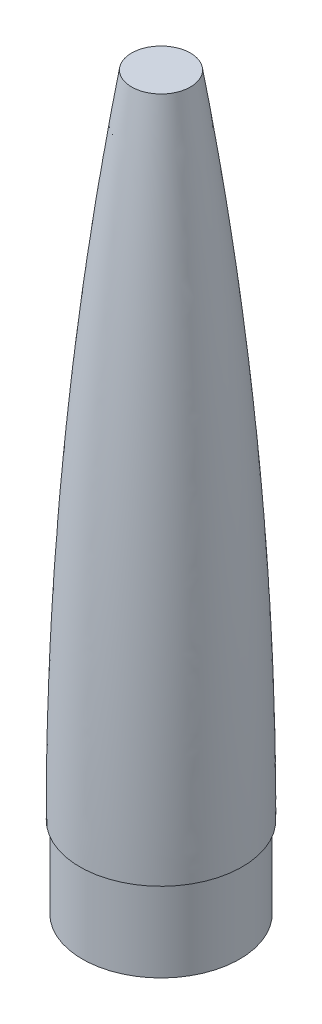
ISO-10303-21;
HEADER;
FILE_DESCRIPTION(('STEP AP214'),'2;1');
FILE_NAME('part.step','',(''),(''),'','','');
FILE_SCHEMA(('AUTOMOTIVE_DESIGN { 1 0 10303 214 1 1 1 1 }'));
ENDSEC;
DATA;
#1=APPLICATION_CONTEXT('core data for automotive mechanical design processes');
#2=APPLICATION_PROTOCOL_DEFINITION('international standard','automotive_design',2000,#1);
#3=PRODUCT_CONTEXT('',#1,'mechanical');
#4=PRODUCT('Part','Part','',(#3));
#5=PRODUCT_RELATED_PRODUCT_CATEGORY('part','',(#4));
#6=PRODUCT_DEFINITION_FORMATION('','',#4);
#7=PRODUCT_DEFINITION_CONTEXT('part definition',#1,'design');
#8=PRODUCT_DEFINITION('design','',#6,#7);
#9=PRODUCT_DEFINITION_SHAPE('','',#8);
#10=(LENGTH_UNIT() NAMED_UNIT(*) SI_UNIT(.MILLI.,.METRE.));
#11=(NAMED_UNIT(*) PLANE_ANGLE_UNIT() SI_UNIT($,.RADIAN.));
#12=(NAMED_UNIT(*) SI_UNIT($,.STERADIAN.) SOLID_ANGLE_UNIT());
#13=UNCERTAINTY_MEASURE_WITH_UNIT(LENGTH_MEASURE(1.E-05),#10,'distance_accuracy_value','');
#14=(GEOMETRIC_REPRESENTATION_CONTEXT(3) GLOBAL_UNCERTAINTY_ASSIGNED_CONTEXT((#13)) GLOBAL_UNIT_ASSIGNED_CONTEXT((#10,
#11,#12)) REPRESENTATION_CONTEXT('',''));
#15=CARTESIAN_POINT('',(0.,0.,0.));
#16=DIRECTION('',(0.,0.,1.));
#17=DIRECTION('',(1.,0.,0.));
#18=AXIS2_PLACEMENT_3D('',#15,#16,#17);
#19=CARTESIAN_POINT('',(1.71600060805526E-11,812.8,0.));
#20=DIRECTION('',(0.,-1.,0.));
#21=DIRECTION('',(0.,0.,-1.));
#22=AXIS2_PLACEMENT_3D('',#19,#20,#21);
#23=PLANE('',#22);
#24=CARTESIAN_POINT('',(0.,812.800000000001,0.));
#25=DIRECTION('',(0.,-1.,0.));
#26=DIRECTION('',(0.,0.,-1.));
#27=AXIS2_PLACEMENT_3D('',#24,#25,#26);
#28=CIRCLE('',#27,36.8107382436538);
#29=CARTESIAN_POINT('',(0.,812.800000000001,-36.8107382436538));
#30=VERTEX_POINT('',#29);
#31=EDGE_CURVE('E10',#30,#30,#28,.T.);
#32=ORIENTED_EDGE('',*,*,#31,.F.);
#33=EDGE_LOOP('',(#32));
#34=FACE_BOUND('',#33,.T.);
#35=ADVANCED_FACE('F34',(#34),#23,.F.);
#36=CARTESIAN_POINT('',(-36.8107382436399,812.800000000088,0.));
#37=CARTESIAN_POINT('',(-36.9942778675381,811.656036287534,0.));
#38=CARTESIAN_POINT('',(-37.3628701438847,809.352341120219,0.));
#39=CARTESIAN_POINT('',(-38.4059770860057,802.812851723432,0.));
#40=CARTESIAN_POINT('',(-39.4063445534059,796.466868939399,0.));
#41=CARTESIAN_POINT('',(-40.5094000899044,789.417479858415,0.));
#42=CARTESIAN_POINT('',(-41.5636705533657,782.608785029749,0.));
#43=CARTESIAN_POINT('',(-42.4113425012624,777.097281594064,0.));
#44=CARTESIAN_POINT('',(-43.2542378182177,771.576058872733,0.));
#45=CARTESIAN_POINT('',(-44.0966419124056,766.017705101634,0.));
#46=CARTESIAN_POINT('',(-44.9372574635269,760.429599919701,0.));
#47=CARTESIAN_POINT('',(-45.7762764460643,754.809835943887,0.));
#48=CARTESIAN_POINT('',(-46.8172442930843,747.784136419474,0.));
#49=CARTESIAN_POINT('',(-48.0539669097659,739.351391314448,0.));
#50=CARTESIAN_POINT('',(-49.4786435972294,729.510576954662,0.));
#51=CARTESIAN_POINT('',(-51.8835815258252,712.635208419306,0.));
#52=CARTESIAN_POINT('',(-56.1784053374686,681.680921395609,0.));
#53=CARTESIAN_POINT('',(-64.3108872319733,619.70971154683,0.));
#54=CARTESIAN_POINT('',(-79.9569813158618,484.234101922189,0.));
#55=CARTESIAN_POINT('',(-91.5619165522518,342.613670709071,0.));
#56=CARTESIAN_POINT('',(-98.2796599898014,206.379377523321,0.));
#57=CARTESIAN_POINT('',(-100.665151632326,101.288631045201,0.));
#58=CARTESIAN_POINT('',(-101.121916521398,71.4617361512993,0.));
#59=CARTESIAN_POINT('',(-101.305723043407,55.1271513591144,0.));
#60=CARTESIAN_POINT('',(-101.362315117216,49.445475511436,0.));
#61=CARTESIAN_POINT('',(-101.40133044313,45.2148835602699,0.));
#62=CARTESIAN_POINT('',(-101.436995751518,41.014909000731,0.));
#63=CARTESIAN_POINT('',(-101.474006364349,36.1352064160095,0.));
#64=CARTESIAN_POINT('',(-101.510147859518,30.5749997133623,0.));
#65=CARTESIAN_POINT('',(-101.540265836947,25.0243241942418,0.));
#66=CARTESIAN_POINT('',(-101.564360261357,19.4325637363225,0.));
#67=CARTESIAN_POINT('',(-101.582431104395,13.9273200626215,0.));
#68=CARTESIAN_POINT('',(-101.594478344888,8.48550626468115,0.));
#69=CARTESIAN_POINT('',(-101.598996062713,3.49324912068522,0.));
#70=CARTESIAN_POINT('',(-101.600000000008,1.15859381780288,0.));
#71=CARTESIAN_POINT('',(-101.600000000008,3.29251402703047E-12,0.));
#72=B_SPLINE_CURVE_WITH_KNOTS('',4,(#36,#37,#38,#39,#40,#41,#42,#43,#44,#45,#46,#47,#48,#49,#50,
#51,#52,#53,#54,#55,#56,#57,#58,#59,#60,#61,#62,#63,#64,#65,#66,#67,#68,#69,#70,#71),
.UNSPECIFIED.,.F.,.F.,(5,1,1,1,1,1,1,1,1,1,1,1,1,1,1,1,1,1,1,1,1,1,1,1,1,1,1,1,1,1,1,1,5),
(0.0833623092059593,0.0890400308531439,0.0947177525003284,0.106073195794698,0.111750917441882,
0.117428639089067,0.123106360736251,0.128784082383436,0.134587047619085,0.140390012854735,
0.146192978090384,0.151995943326034,0.163601873797332,0.175207804268631,0.186813734709129,
0.22163152603062,0.291267108032858,0.430538273603116,0.743898395082925,0.801928047381381,
0.84835176909009,0.859957699551707,0.865760664782516,0.86866214739792,0.871563630013324,
0.87724135137609,0.882919072738856,0.888596794101622,0.894274515464387,0.899952236827153,
0.905629958189919,0.911307679552684,0.91698540091545),.UNSPECIFIED.);
#73=CARTESIAN_POINT('',(0.,0.,0.));
#74=DIRECTION('',(0.,-1.,0.));
#75=AXIS1_PLACEMENT('',#73,#74);
#76=SURFACE_OF_REVOLUTION('',#72,#75);
#77=CARTESIAN_POINT('',(0.,1.33226762955019E-12,0.));
#78=DIRECTION('',(0.,-1.,0.));
#79=DIRECTION('',(0.,0.,-1.));
#80=AXIS2_PLACEMENT_3D('',#77,#78,#79);
#81=CIRCLE('',#80,101.600000000008);
#82=CARTESIAN_POINT('',(0.,1.33226762955019E-12,-101.600000000008));
#83=VERTEX_POINT('',#82);
#84=EDGE_CURVE('E40',#83,#83,#81,.T.);
#85=ORIENTED_EDGE('',*,*,#84,.F.);
#86=EDGE_LOOP('',(#85));
#87=FACE_BOUND('',#86,.T.);
#88=ORIENTED_EDGE('',*,*,#31,.T.);
#89=EDGE_LOOP('',(#88));
#90=FACE_BOUND('',#89,.T.);
#91=ADVANCED_FACE('F64',(#87,#90),#76,.T.);
#92=CARTESIAN_POINT('',(0.,6.66133814775094E-13,0.));
#93=DIRECTION('',(0.,-1.,0.));
#94=DIRECTION('',(0.,0.,-1.));
#95=AXIS2_PLACEMENT_3D('',#92,#93,#94);
#96=PLANE('',#95);
#97=ORIENTED_EDGE('',*,*,#84,.T.);
#98=EDGE_LOOP('',(#97));
#99=FACE_BOUND('',#98,.T.);
#100=CARTESIAN_POINT('',(0.,0.,0.));
#101=DIRECTION('',(0.,-1.,0.));
#102=DIRECTION('',(0.,0.,-1.));
#103=AXIS2_PLACEMENT_3D('',#100,#101,#102);
#104=CIRCLE('',#103,98.4250000000084);
#105=CARTESIAN_POINT('',(0.,0.,-98.4250000000084));
#106=VERTEX_POINT('',#105);
#107=EDGE_CURVE('E44',#106,#106,#104,.T.);
#108=ORIENTED_EDGE('',*,*,#107,.F.);
#109=EDGE_LOOP('',(#108));
#110=FACE_BOUND('',#109,.T.);
#111=ADVANCED_FACE('F69',(#99,#110),#96,.T.);
#112=CARTESIAN_POINT('',(0.,0.,0.));
#113=DIRECTION('',(0.,-1.,0.));
#114=DIRECTION('',(0.,0.,-1.));
#115=AXIS2_PLACEMENT_3D('',#112,#113,#114);
#116=CYLINDRICAL_SURFACE('',#115,98.4250000000083);
#117=CARTESIAN_POINT('',(0.,-101.6,0.));
#118=DIRECTION('',(0.,-1.,0.));
#119=DIRECTION('',(0.,0.,-1.));
#120=AXIS2_PLACEMENT_3D('',#117,#118,#119);
#121=CIRCLE('',#120,98.4250000000083);
#122=CARTESIAN_POINT('',(0.,-101.6,-98.4250000000083));
#123=VERTEX_POINT('',#122);
#124=EDGE_CURVE('E48',#123,#123,#121,.T.);
#125=ORIENTED_EDGE('',*,*,#124,.F.);
#126=EDGE_LOOP('',(#125));
#127=FACE_BOUND('',#126,.T.);
#128=ORIENTED_EDGE('',*,*,#107,.T.);
#129=EDGE_LOOP('',(#128));
#130=FACE_BOUND('',#129,.T.);
#131=ADVANCED_FACE('F85',(#127,#130),#116,.T.);
#132=CARTESIAN_POINT('',(0.,-101.6,0.));
#133=DIRECTION('',(0.,1.,0.));
#134=DIRECTION('',(0.,0.,1.));
#135=AXIS2_PLACEMENT_3D('',#132,#133,#134);
#136=PLANE('',#135);
#137=CARTESIAN_POINT('',(0.,-101.6,0.));
#138=DIRECTION('',(0.,1.,0.));
#139=DIRECTION('',(0.,0.,1.));
#140=AXIS2_PLACEMENT_3D('',#137,#138,#139);
#141=CIRCLE('',#140,95.2500000000083);
#142=CARTESIAN_POINT('',(0.,-101.6,95.2500000000083));
#143=VERTEX_POINT('',#142);
#144=EDGE_CURVE('E58',#143,#143,#141,.F.);
#145=ORIENTED_EDGE('',*,*,#144,.F.);
#146=EDGE_LOOP('',(#145));
#147=FACE_BOUND('',#146,.T.);
#148=ORIENTED_EDGE('',*,*,#124,.T.);
#149=EDGE_LOOP('',(#148));
#150=FACE_BOUND('',#149,.T.);
#151=ADVANCED_FACE('F81',(#147,#150),#136,.F.);
#152=CARTESIAN_POINT('',(1.71600060805526E-11,809.625,0.));
#153=DIRECTION('',(0.,-1.,0.));
#154=DIRECTION('',(0.,0.,-1.));
#155=AXIS2_PLACEMENT_3D('',#152,#153,#154);
#156=PLANE('',#155);
#157=CARTESIAN_POINT('',(0.,809.625,0.));
#158=DIRECTION('',(0.,-1.,0.));
#159=DIRECTION('',(0.,0.,-1.));
#160=AXIS2_PLACEMENT_3D('',#157,#158,#159);
#161=CIRCLE('',#160,34.103598259922);
#162=CARTESIAN_POINT('',(0.,809.625,-34.103598259922));
#163=VERTEX_POINT('',#162);
#164=EDGE_CURVE('E53',#163,#163,#161,.T.);
#165=ORIENTED_EDGE('',*,*,#164,.T.);
#166=EDGE_LOOP('',(#165));
#167=FACE_BOUND('',#166,.T.);
#168=ADVANCED_FACE('F84',(#167),#156,.T.);
#169=CARTESIAN_POINT('',(-36.8107382436399,812.800000000088,0.));
#170=CARTESIAN_POINT('',(-36.9942778675381,811.656036287534,0.));
#171=CARTESIAN_POINT('',(-37.3628701438847,809.352341120219,0.));
#172=CARTESIAN_POINT('',(-38.4059770860057,802.812851723432,0.));
#173=CARTESIAN_POINT('',(-39.4063445534059,796.466868939399,0.));
#174=CARTESIAN_POINT('',(-40.5094000899044,789.417479858415,0.));
#175=CARTESIAN_POINT('',(-41.5636705533657,782.608785029749,0.));
#176=CARTESIAN_POINT('',(-42.4113425012624,777.097281594064,0.));
#177=CARTESIAN_POINT('',(-43.2542378182177,771.576058872733,0.));
#178=CARTESIAN_POINT('',(-44.0966419124056,766.017705101634,0.));
#179=CARTESIAN_POINT('',(-44.9372574635269,760.429599919701,0.));
#180=CARTESIAN_POINT('',(-45.7762764460643,754.809835943887,0.));
#181=CARTESIAN_POINT('',(-46.8172442930843,747.784136419474,0.));
#182=CARTESIAN_POINT('',(-48.0539669097659,739.351391314448,0.));
#183=CARTESIAN_POINT('',(-49.4786435972294,729.510576954662,0.));
#184=CARTESIAN_POINT('',(-51.8835815258252,712.635208419306,0.));
#185=CARTESIAN_POINT('',(-56.1784053374686,681.680921395609,0.));
#186=CARTESIAN_POINT('',(-64.3108872319733,619.70971154683,0.));
#187=CARTESIAN_POINT('',(-79.9569813158618,484.234101922189,0.));
#188=CARTESIAN_POINT('',(-91.5619165522518,342.613670709071,0.));
#189=CARTESIAN_POINT('',(-98.2796599898014,206.379377523321,0.));
#190=CARTESIAN_POINT('',(-100.665151632326,101.288631045201,0.));
#191=CARTESIAN_POINT('',(-101.121916521398,71.4617361512993,0.));
#192=CARTESIAN_POINT('',(-101.305723043407,55.1271513591144,0.));
#193=CARTESIAN_POINT('',(-101.362315117216,49.445475511436,0.));
#194=CARTESIAN_POINT('',(-101.40133044313,45.2148835602699,0.));
#195=CARTESIAN_POINT('',(-101.436995751518,41.014909000731,0.));
#196=CARTESIAN_POINT('',(-101.474006364349,36.1352064160095,0.));
#197=CARTESIAN_POINT('',(-101.510147859518,30.5749997133623,0.));
#198=CARTESIAN_POINT('',(-101.540265836947,25.0243241942418,0.));
#199=CARTESIAN_POINT('',(-101.564360261357,19.4325637363225,0.));
#200=CARTESIAN_POINT('',(-101.582431104395,13.9273200626215,0.));
#201=CARTESIAN_POINT('',(-101.594478344888,8.48550626468115,0.));
#202=CARTESIAN_POINT('',(-101.598996062713,3.49324912068522,0.));
#203=CARTESIAN_POINT('',(-101.600000000008,1.15859381780288,0.));
#204=CARTESIAN_POINT('',(-101.600000000008,3.29251402703047E-12,0.));
#205=B_SPLINE_CURVE_WITH_KNOTS('',4,(#169,#170,#171,#172,#173,#174,#175,#176,#177,#178,#179,
#180,#181,#182,#183,#184,#185,#186,#187,#188,#189,#190,#191,#192,#193,#194,#195,#196,#197,#198,
#199,#200,#201,#202,#203,#204),.UNSPECIFIED.,.F.,.F.,(5,1,1,1,1,1,1,1,1,1,1,1,1,1,1,1,1,1,1,1,1,
1,1,1,1,1,1,1,1,1,1,1,5),(0.0833623092059593,0.0890400308531439,0.0947177525003284,
0.106073195794698,0.111750917441882,0.117428639089067,0.123106360736251,0.128784082383436,
0.134587047619085,0.140390012854735,0.146192978090384,0.151995943326034,0.163601873797332,
0.175207804268631,0.186813734709129,0.22163152603062,0.291267108032858,0.430538273603116,
0.743898395082925,0.801928047381381,0.84835176909009,0.859957699551707,0.865760664782516,
0.86866214739792,0.871563630013324,0.87724135137609,0.882919072738856,0.888596794101622,
0.894274515464387,0.899952236827153,0.905629958189919,0.911307679552684,0.91698540091545),.UNSPECIFIED.);
#206=CARTESIAN_POINT('',(0.,0.,0.));
#207=DIRECTION('',(0.,-1.,0.));
#208=AXIS1_PLACEMENT('',#206,#207);
#209=SURFACE_OF_REVOLUTION('',#205,#208);
#210=OFFSET_SURFACE('',#209,-3.175,.F.);
#211=CARTESIAN_POINT('',(0.,3.17500000000069,0.));
#212=DIRECTION('',(0.,-1.,0.));
#213=DIRECTION('',(0.,0.,-1.));
#214=AXIS2_PLACEMENT_3D('',#211,#212,#213);
#215=CIRCLE('',#214,98.4237614677854);
#216=CARTESIAN_POINT('',(0.,3.17500000000069,-98.4237614677854));
#217=VERTEX_POINT('',#216);
#218=EDGE_CURVE('E146',#217,#217,#215,.T.);
#219=ORIENTED_EDGE('',*,*,#218,.T.);
#220=EDGE_LOOP('',(#219));
#221=FACE_BOUND('',#220,.T.);
#222=ORIENTED_EDGE('',*,*,#164,.F.);
#223=EDGE_LOOP('',(#222));
#224=FACE_BOUND('',#223,.T.);
#225=ADVANCED_FACE('F71',(#221,#224),#210,.F.);
#226=CARTESIAN_POINT('',(0.,3.17500000000067,0.));
#227=DIRECTION('',(0.,-1.,0.));
#228=DIRECTION('',(0.,0.,-1.));
#229=AXIS2_PLACEMENT_3D('',#226,#227,#228);
#230=PLANE('',#229);
#231=ORIENTED_EDGE('',*,*,#218,.F.);
#232=EDGE_LOOP('',(#231));
#233=FACE_BOUND('',#232,.T.);
#234=CARTESIAN_POINT('',(0.,3.17500000000067,0.));
#235=DIRECTION('',(0.,-1.,0.));
#236=DIRECTION('',(0.,0.,-1.));
#237=AXIS2_PLACEMENT_3D('',#234,#235,#236);
#238=CIRCLE('',#237,95.2500000000083);
#239=CARTESIAN_POINT('',(0.,3.17500000000067,-95.2500000000083));
#240=VERTEX_POINT('',#239);
#241=EDGE_CURVE('E150',#240,#240,#238,.T.);
#242=ORIENTED_EDGE('',*,*,#241,.T.);
#243=EDGE_LOOP('',(#242));
#244=FACE_BOUND('',#243,.T.);
#245=ADVANCED_FACE('F73',(#233,#244),#230,.F.);
#246=CARTESIAN_POINT('',(0.,0.,0.));
#247=DIRECTION('',(0.,-1.,0.));
#248=DIRECTION('',(0.,0.,-1.));
#249=AXIS2_PLACEMENT_3D('',#246,#247,#248);
#250=CYLINDRICAL_SURFACE('',#249,95.2500000000083);
#251=ORIENTED_EDGE('',*,*,#144,.T.);
#252=EDGE_LOOP('',(#251));
#253=FACE_BOUND('',#252,.T.);
#254=ORIENTED_EDGE('',*,*,#241,.F.);
#255=EDGE_LOOP('',(#254));
#256=FACE_BOUND('',#255,.T.);
#257=ADVANCED_FACE('F76',(#253,#256),#250,.F.);
#258=CLOSED_SHELL('',(#35,#91,#111,#131,#151,#168,#225,#245,#257));
#259=MANIFOLD_SOLID_BREP('B2',#258);
#260=ADVANCED_BREP_SHAPE_REPRESENTATION('',(#18,#259),#14);
#261=SHAPE_DEFINITION_REPRESENTATION(#9,#260);
ENDSEC;
END-ISO-10303-21;
